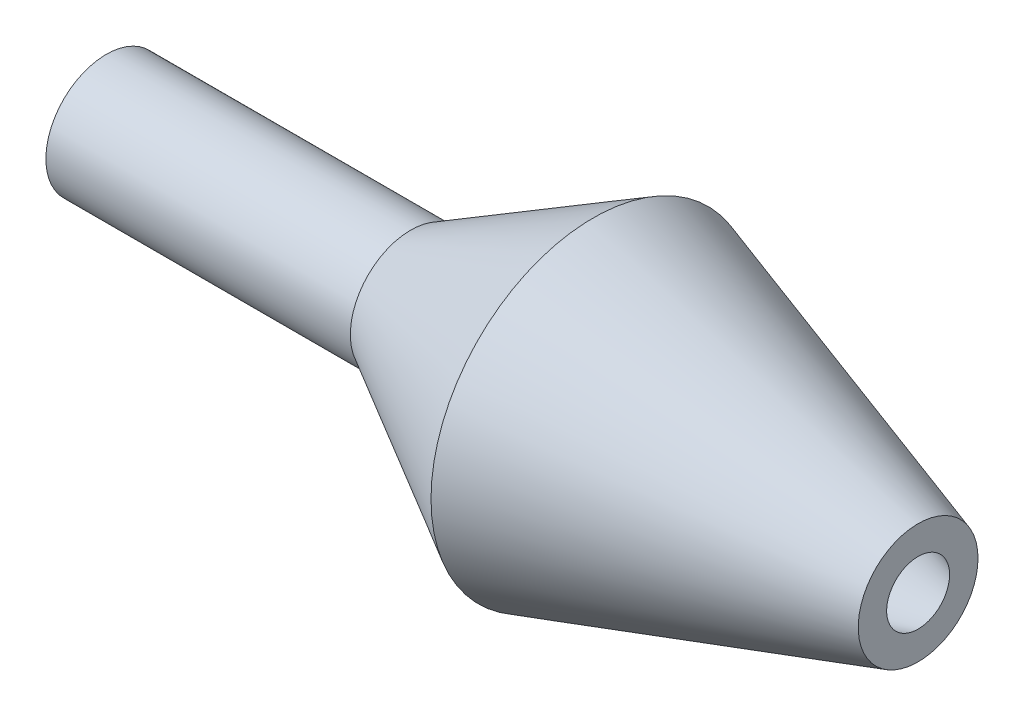
ISO-10303-21;
HEADER;
FILE_DESCRIPTION(('STEP AP214'),'2;1');
FILE_NAME('part.step','',(''),(''),'','','');
FILE_SCHEMA(('AUTOMOTIVE_DESIGN { 1 0 10303 214 1 1 1 1 }'));
ENDSEC;
DATA;
#1=APPLICATION_CONTEXT('core data for automotive mechanical design processes');
#2=APPLICATION_PROTOCOL_DEFINITION('international standard','automotive_design',2000,#1);
#3=PRODUCT_CONTEXT('',#1,'mechanical');
#4=PRODUCT('Part','Part','',(#3));
#5=PRODUCT_RELATED_PRODUCT_CATEGORY('part','',(#4));
#6=PRODUCT_DEFINITION_FORMATION('','',#4);
#7=PRODUCT_DEFINITION_CONTEXT('part definition',#1,'design');
#8=PRODUCT_DEFINITION('design','',#6,#7);
#9=PRODUCT_DEFINITION_SHAPE('','',#8);
#10=(LENGTH_UNIT() NAMED_UNIT(*) SI_UNIT(.MILLI.,.METRE.));
#11=(NAMED_UNIT(*) PLANE_ANGLE_UNIT() SI_UNIT($,.RADIAN.));
#12=(NAMED_UNIT(*) SI_UNIT($,.STERADIAN.) SOLID_ANGLE_UNIT());
#13=UNCERTAINTY_MEASURE_WITH_UNIT(LENGTH_MEASURE(1.E-05),#10,'distance_accuracy_value','');
#14=(GEOMETRIC_REPRESENTATION_CONTEXT(3) GLOBAL_UNCERTAINTY_ASSIGNED_CONTEXT((#13)) GLOBAL_UNIT_ASSIGNED_CONTEXT((#10,
#11,#12)) REPRESENTATION_CONTEXT('',''));
#15=CARTESIAN_POINT('',(0.,0.,0.));
#16=DIRECTION('',(0.,0.,1.));
#17=DIRECTION('',(1.,0.,0.));
#18=AXIS2_PLACEMENT_3D('',#15,#16,#17);
#19=CARTESIAN_POINT('',(-40.,0.,-2.975));
#20=DIRECTION('',(-1.,0.,0.));
#21=DIRECTION('',(0.,0.,1.));
#22=AXIS2_PLACEMENT_3D('',#19,#20,#21);
#23=PLANE('',#22);
#24=CARTESIAN_POINT('',(-40.,0.,0.));
#25=DIRECTION('',(1.,0.,0.));
#26=DIRECTION('',(0.,0.,-1.));
#27=AXIS2_PLACEMENT_3D('',#24,#25,#26);
#28=CIRCLE('',#27,1.575);
#29=CARTESIAN_POINT('',(-40.,0.,-1.575));
#30=VERTEX_POINT('',#29);
#31=EDGE_CURVE('E10',#30,#30,#28,.T.);
#32=ORIENTED_EDGE('',*,*,#31,.T.);
#33=EDGE_LOOP('',(#32));
#34=FACE_BOUND('',#33,.T.);
#35=CARTESIAN_POINT('',(-40.,0.,0.));
#36=DIRECTION('',(1.,0.,0.));
#37=DIRECTION('',(0.,0.,-1.));
#38=AXIS2_PLACEMENT_3D('',#35,#36,#37);
#39=CIRCLE('',#38,2.975);
#40=CARTESIAN_POINT('',(-40.,0.,-2.975));
#41=VERTEX_POINT('',#40);
#42=EDGE_CURVE('E69',#41,#41,#39,.T.);
#43=ORIENTED_EDGE('',*,*,#42,.F.);
#44=EDGE_LOOP('',(#43));
#45=FACE_BOUND('',#44,.T.);
#46=ADVANCED_FACE('F41',(#34,#45),#23,.T.);
#47=CARTESIAN_POINT('',(0.,0.,0.));
#48=DIRECTION('',(1.,0.,0.));
#49=DIRECTION('',(0.,0.,-1.));
#50=AXIS2_PLACEMENT_3D('',#47,#48,#49);
#51=CYLINDRICAL_SURFACE('',#50,1.575);
#52=CARTESIAN_POINT('',(-25.,0.,0.));
#53=DIRECTION('',(1.,0.,0.));
#54=DIRECTION('',(0.,0.,-1.));
#55=AXIS2_PLACEMENT_3D('',#52,#53,#54);
#56=CIRCLE('',#55,1.575);
#57=CARTESIAN_POINT('',(-25.,0.,-1.575));
#58=VERTEX_POINT('',#57);
#59=EDGE_CURVE('E47',#58,#58,#56,.T.);
#60=ORIENTED_EDGE('',*,*,#59,.T.);
#61=EDGE_LOOP('',(#60));
#62=FACE_BOUND('',#61,.T.);
#63=ORIENTED_EDGE('',*,*,#31,.F.);
#64=EDGE_LOOP('',(#63));
#65=FACE_BOUND('',#64,.T.);
#66=ADVANCED_FACE('F77',(#62,#65),#51,.F.);
#67=CARTESIAN_POINT('',(-25.,0.,0.));
#68=DIRECTION('',(1.,0.,0.));
#69=DIRECTION('',(0.,0.,-1.));
#70=AXIS2_PLACEMENT_3D('',#67,#68,#69);
#71=CONICAL_SURFACE('',#70,1.575,0.509218642558424);
#72=CARTESIAN_POINT('',(-16.,0.,0.));
#73=DIRECTION('',(1.,0.,0.));
#74=DIRECTION('',(0.,0.,-1.));
#75=AXIS2_PLACEMENT_3D('',#72,#73,#74);
#76=CIRCLE('',#75,6.6);
#77=CARTESIAN_POINT('',(-16.,0.,-6.6));
#78=VERTEX_POINT('',#77);
#79=EDGE_CURVE('E51',#78,#78,#76,.T.);
#80=ORIENTED_EDGE('',*,*,#79,.T.);
#81=EDGE_LOOP('',(#80));
#82=FACE_BOUND('',#81,.T.);
#83=ORIENTED_EDGE('',*,*,#59,.F.);
#84=EDGE_LOOP('',(#83));
#85=FACE_BOUND('',#84,.T.);
#86=ADVANCED_FACE('F81',(#82,#85),#71,.F.);
#87=CARTESIAN_POINT('',(-16.,0.,0.));
#88=DIRECTION('',(-1.,0.,0.));
#89=DIRECTION('',(0.,0.,1.));
#90=AXIS2_PLACEMENT_3D('',#87,#88,#89);
#91=CONICAL_SURFACE('',#90,6.6,0.305729305148115);
#92=CARTESIAN_POINT('',(0.,0.,0.));
#93=DIRECTION('',(1.,0.,0.));
#94=DIRECTION('',(0.,0.,-1.));
#95=AXIS2_PLACEMENT_3D('',#92,#93,#94);
#96=CIRCLE('',#95,1.55);
#97=CARTESIAN_POINT('',(0.,0.,-1.55));
#98=VERTEX_POINT('',#97);
#99=EDGE_CURVE('E55',#98,#98,#96,.T.);
#100=ORIENTED_EDGE('',*,*,#99,.T.);
#101=EDGE_LOOP('',(#100));
#102=FACE_BOUND('',#101,.T.);
#103=ORIENTED_EDGE('',*,*,#79,.F.);
#104=EDGE_LOOP('',(#103));
#105=FACE_BOUND('',#104,.T.);
#106=ADVANCED_FACE('F85',(#102,#105),#91,.F.);
#107=CARTESIAN_POINT('',(0.,0.,-2.95));
#108=DIRECTION('',(1.,0.,0.));
#109=DIRECTION('',(0.,0.,-1.));
#110=AXIS2_PLACEMENT_3D('',#107,#108,#109);
#111=PLANE('',#110);
#112=CARTESIAN_POINT('',(0.,0.,0.));
#113=DIRECTION('',(1.,0.,0.));
#114=DIRECTION('',(0.,0.,-1.));
#115=AXIS2_PLACEMENT_3D('',#112,#113,#114);
#116=CIRCLE('',#115,2.95);
#117=CARTESIAN_POINT('',(0.,0.,-2.95));
#118=VERTEX_POINT('',#117);
#119=EDGE_CURVE('E60',#118,#118,#116,.T.);
#120=ORIENTED_EDGE('',*,*,#119,.T.);
#121=EDGE_LOOP('',(#120));
#122=FACE_BOUND('',#121,.T.);
#123=ORIENTED_EDGE('',*,*,#99,.F.);
#124=EDGE_LOOP('',(#123));
#125=FACE_BOUND('',#124,.T.);
#126=ADVANCED_FACE('F92',(#122,#125),#111,.T.);
#127=CARTESIAN_POINT('',(0.,0.,0.));
#128=DIRECTION('',(-1.,0.,0.));
#129=DIRECTION('',(0.,0.,1.));
#130=AXIS2_PLACEMENT_3D('',#127,#128,#129);
#131=CONICAL_SURFACE('',#130,2.95,0.305729305148115);
#132=CARTESIAN_POINT('',(-16.,0.,0.));
#133=DIRECTION('',(1.,0.,0.));
#134=DIRECTION('',(0.,0.,-1.));
#135=AXIS2_PLACEMENT_3D('',#132,#133,#134);
#136=CIRCLE('',#135,8.);
#137=CARTESIAN_POINT('',(-16.,0.,-8.));
#138=VERTEX_POINT('',#137);
#139=EDGE_CURVE('E63',#138,#138,#136,.T.);
#140=ORIENTED_EDGE('',*,*,#139,.T.);
#141=EDGE_LOOP('',(#140));
#142=FACE_BOUND('',#141,.T.);
#143=ORIENTED_EDGE('',*,*,#119,.F.);
#144=EDGE_LOOP('',(#143));
#145=FACE_BOUND('',#144,.T.);
#146=ADVANCED_FACE('F96',(#142,#145),#131,.T.);
#147=CARTESIAN_POINT('',(-16.,0.,0.));
#148=DIRECTION('',(1.,0.,0.));
#149=DIRECTION('',(0.,0.,-1.));
#150=AXIS2_PLACEMENT_3D('',#147,#148,#149);
#151=CONICAL_SURFACE('',#150,8.,0.509218642558424);
#152=CARTESIAN_POINT('',(-25.,0.,0.));
#153=DIRECTION('',(1.,0.,0.));
#154=DIRECTION('',(0.,0.,-1.));
#155=AXIS2_PLACEMENT_3D('',#152,#153,#154);
#156=CIRCLE('',#155,2.975);
#157=CARTESIAN_POINT('',(-25.,0.,-2.975));
#158=VERTEX_POINT('',#157);
#159=EDGE_CURVE('E66',#158,#158,#156,.T.);
#160=ORIENTED_EDGE('',*,*,#159,.T.);
#161=EDGE_LOOP('',(#160));
#162=FACE_BOUND('',#161,.T.);
#163=ORIENTED_EDGE('',*,*,#139,.F.);
#164=EDGE_LOOP('',(#163));
#165=FACE_BOUND('',#164,.T.);
#166=ADVANCED_FACE('F100',(#162,#165),#151,.T.);
#167=CARTESIAN_POINT('',(0.,0.,0.));
#168=DIRECTION('',(1.,0.,0.));
#169=DIRECTION('',(0.,0.,-1.));
#170=AXIS2_PLACEMENT_3D('',#167,#168,#169);
#171=CYLINDRICAL_SURFACE('',#170,2.975);
#172=ORIENTED_EDGE('',*,*,#42,.T.);
#173=EDGE_LOOP('',(#172));
#174=FACE_BOUND('',#173,.T.);
#175=ORIENTED_EDGE('',*,*,#159,.F.);
#176=EDGE_LOOP('',(#175));
#177=FACE_BOUND('',#176,.T.);
#178=ADVANCED_FACE('F73',(#174,#177),#171,.T.);
#179=CLOSED_SHELL('',(#46,#66,#86,#106,#126,#146,#166,#178));
#180=MANIFOLD_SOLID_BREP('B2',#179);
#181=ADVANCED_BREP_SHAPE_REPRESENTATION('',(#18,#180),#14);
#182=SHAPE_DEFINITION_REPRESENTATION(#9,#181);
ENDSEC;
END-ISO-10303-21;
